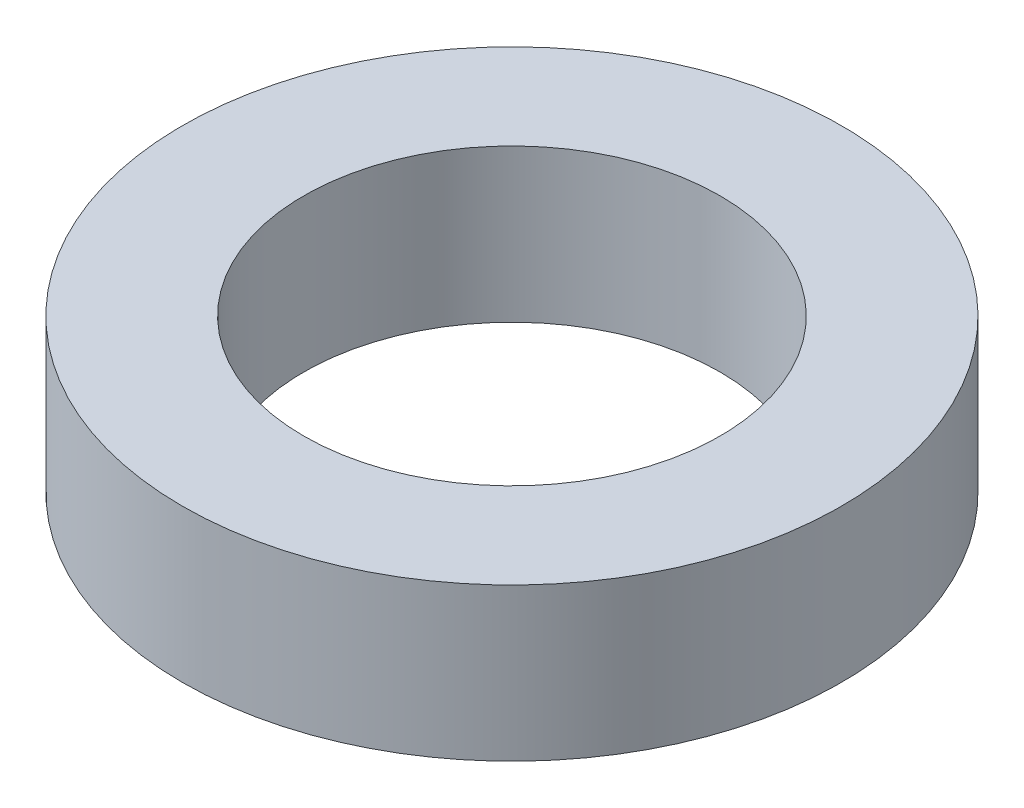
ISO-10303-21;
HEADER;
FILE_DESCRIPTION(('STEP AP214'),'2;1');
FILE_NAME('part.step','',(''),(''),'','','');
FILE_SCHEMA(('AUTOMOTIVE_DESIGN { 1 0 10303 214 1 1 1 1 }'));
ENDSEC;
DATA;
#1=APPLICATION_CONTEXT('core data for automotive mechanical design processes');
#2=APPLICATION_PROTOCOL_DEFINITION('international standard','automotive_design',2000,#1);
#3=PRODUCT_CONTEXT('',#1,'mechanical');
#4=PRODUCT('Part','Part','',(#3));
#5=PRODUCT_RELATED_PRODUCT_CATEGORY('part','',(#4));
#6=PRODUCT_DEFINITION_FORMATION('','',#4);
#7=PRODUCT_DEFINITION_CONTEXT('part definition',#1,'design');
#8=PRODUCT_DEFINITION('design','',#6,#7);
#9=PRODUCT_DEFINITION_SHAPE('','',#8);
#10=(LENGTH_UNIT() NAMED_UNIT(*) SI_UNIT(.MILLI.,.METRE.));
#11=(NAMED_UNIT(*) PLANE_ANGLE_UNIT() SI_UNIT($,.RADIAN.));
#12=(NAMED_UNIT(*) SI_UNIT($,.STERADIAN.) SOLID_ANGLE_UNIT());
#13=UNCERTAINTY_MEASURE_WITH_UNIT(LENGTH_MEASURE(1.E-05),#10,'distance_accuracy_value','');
#14=(GEOMETRIC_REPRESENTATION_CONTEXT(3) GLOBAL_UNCERTAINTY_ASSIGNED_CONTEXT((#13)) GLOBAL_UNIT_ASSIGNED_CONTEXT((#10,
#11,#12)) REPRESENTATION_CONTEXT('',''));
#15=CARTESIAN_POINT('',(0.,0.,0.));
#16=DIRECTION('',(0.,0.,1.));
#17=DIRECTION('',(1.,0.,0.));
#18=AXIS2_PLACEMENT_3D('',#15,#16,#17);
#19=CARTESIAN_POINT('',(0.,22.,0.));
#20=DIRECTION('',(0.,-1.,0.));
#21=DIRECTION('',(0.,0.,-1.));
#22=AXIS2_PLACEMENT_3D('',#19,#20,#21);
#23=CYLINDRICAL_SURFACE('',#22,47.5);
#24=CARTESIAN_POINT('',(0.,22.,0.));
#25=DIRECTION('',(0.,1.,0.));
#26=DIRECTION('',(0.,0.,1.));
#27=AXIS2_PLACEMENT_3D('',#24,#25,#26);
#28=CIRCLE('',#27,47.5);
#29=CARTESIAN_POINT('',(0.,22.,47.5));
#30=VERTEX_POINT('',#29);
#31=EDGE_CURVE('E10',#30,#30,#28,.T.);
#32=ORIENTED_EDGE('',*,*,#31,.F.);
#33=EDGE_LOOP('',(#32));
#34=FACE_BOUND('',#33,.T.);
#35=CARTESIAN_POINT('',(0.,0.,0.));
#36=DIRECTION('',(0.,1.,0.));
#37=DIRECTION('',(0.,0.,1.));
#38=AXIS2_PLACEMENT_3D('',#35,#36,#37);
#39=CIRCLE('',#38,47.5);
#40=CARTESIAN_POINT('',(0.,0.,47.5));
#41=VERTEX_POINT('',#40);
#42=EDGE_CURVE('E37',#41,#41,#39,.T.);
#43=ORIENTED_EDGE('',*,*,#42,.T.);
#44=EDGE_LOOP('',(#43));
#45=FACE_BOUND('',#44,.T.);
#46=ADVANCED_FACE('F40',(#34,#45),#23,.T.);
#47=CARTESIAN_POINT('',(0.,22.,0.));
#48=DIRECTION('',(0.,1.,0.));
#49=DIRECTION('',(0.,0.,1.));
#50=AXIS2_PLACEMENT_3D('',#47,#48,#49);
#51=PLANE('',#50);
#52=CARTESIAN_POINT('',(0.,22.,0.));
#53=DIRECTION('',(0.,1.,0.));
#54=DIRECTION('',(0.,0.,1.));
#55=AXIS2_PLACEMENT_3D('',#52,#53,#54);
#56=CIRCLE('',#55,30.);
#57=CARTESIAN_POINT('',(0.,22.,30.));
#58=VERTEX_POINT('',#57);
#59=EDGE_CURVE('E50',#58,#58,#56,.T.);
#60=ORIENTED_EDGE('',*,*,#59,.F.);
#61=EDGE_LOOP('',(#60));
#62=FACE_BOUND('',#61,.T.);
#63=ORIENTED_EDGE('',*,*,#31,.T.);
#64=EDGE_LOOP('',(#63));
#65=FACE_BOUND('',#64,.T.);
#66=ADVANCED_FACE('F59',(#62,#65),#51,.T.);
#67=CARTESIAN_POINT('',(0.,0.,0.));
#68=DIRECTION('',(0.,1.,0.));
#69=DIRECTION('',(0.,0.,1.));
#70=AXIS2_PLACEMENT_3D('',#67,#68,#69);
#71=PLANE('',#70);
#72=CARTESIAN_POINT('',(0.,0.,0.));
#73=DIRECTION('',(0.,1.,0.));
#74=DIRECTION('',(0.,0.,1.));
#75=AXIS2_PLACEMENT_3D('',#72,#73,#74);
#76=CIRCLE('',#75,30.);
#77=CARTESIAN_POINT('',(0.,0.,30.));
#78=VERTEX_POINT('',#77);
#79=EDGE_CURVE('E47',#78,#78,#76,.T.);
#80=ORIENTED_EDGE('',*,*,#79,.T.);
#81=EDGE_LOOP('',(#80));
#82=FACE_BOUND('',#81,.T.);
#83=ORIENTED_EDGE('',*,*,#42,.F.);
#84=EDGE_LOOP('',(#83));
#85=FACE_BOUND('',#84,.T.);
#86=ADVANCED_FACE('F58',(#82,#85),#71,.F.);
#87=CARTESIAN_POINT('',(0.,22.,0.));
#88=DIRECTION('',(0.,-1.,0.));
#89=DIRECTION('',(0.,0.,-1.));
#90=AXIS2_PLACEMENT_3D('',#87,#88,#89);
#91=CYLINDRICAL_SURFACE('',#90,30.);
#92=ORIENTED_EDGE('',*,*,#59,.T.);
#93=EDGE_LOOP('',(#92));
#94=FACE_BOUND('',#93,.T.);
#95=ORIENTED_EDGE('',*,*,#79,.F.);
#96=EDGE_LOOP('',(#95));
#97=FACE_BOUND('',#96,.T.);
#98=ADVANCED_FACE('F54',(#94,#97),#91,.F.);
#99=CLOSED_SHELL('',(#46,#66,#86,#98));
#100=MANIFOLD_SOLID_BREP('B2',#99);
#101=ADVANCED_BREP_SHAPE_REPRESENTATION('',(#18,#100),#14);
#102=SHAPE_DEFINITION_REPRESENTATION(#9,#101);
ENDSEC;
END-ISO-10303-21;
